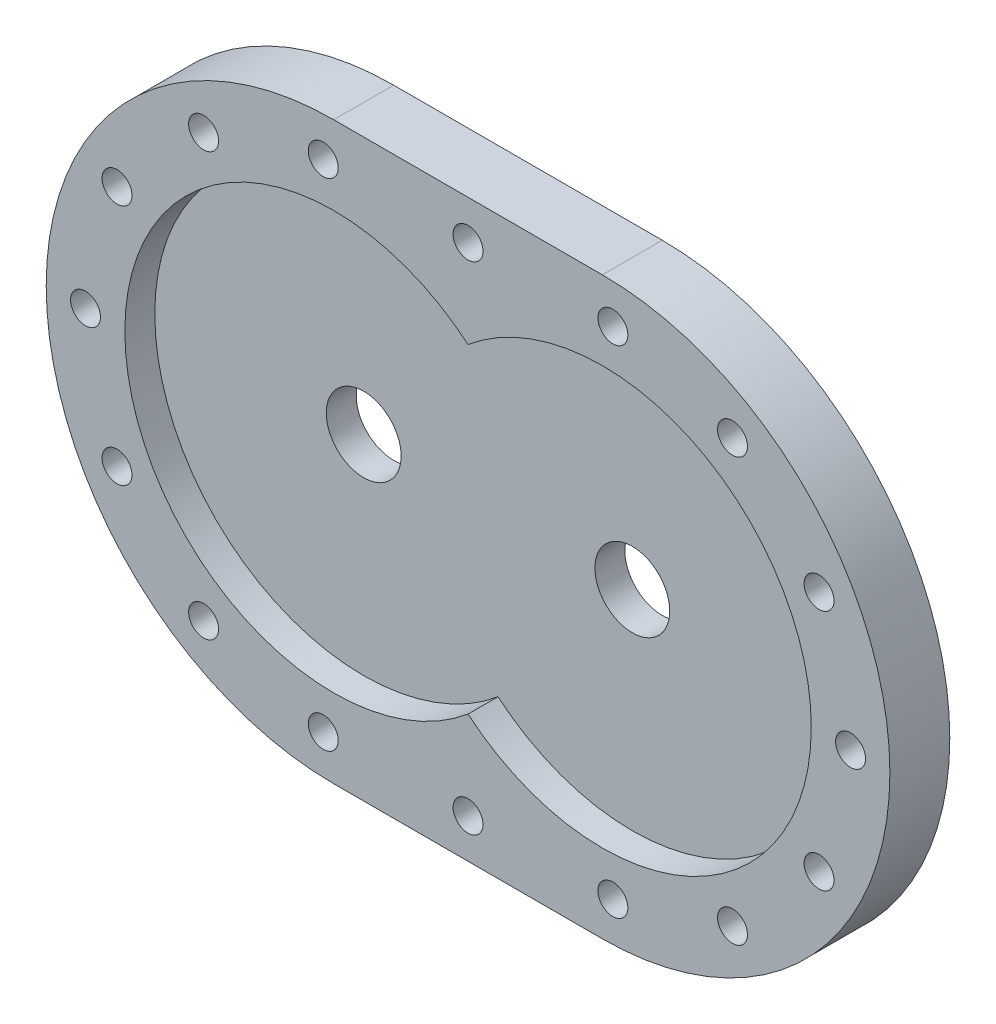
ISO-10303-21;
HEADER;
FILE_DESCRIPTION(('STEP AP214'),'2;1');
FILE_NAME('part.step','',(''),(''),'','','');
FILE_SCHEMA(('AUTOMOTIVE_DESIGN { 1 0 10303 214 1 1 1 1 }'));
ENDSEC;
DATA;
#1=APPLICATION_CONTEXT('core data for automotive mechanical design processes');
#2=APPLICATION_PROTOCOL_DEFINITION('international standard','automotive_design',2000,#1);
#3=PRODUCT_CONTEXT('',#1,'mechanical');
#4=PRODUCT('Part','Part','',(#3));
#5=PRODUCT_RELATED_PRODUCT_CATEGORY('part','',(#4));
#6=PRODUCT_DEFINITION_FORMATION('','',#4);
#7=PRODUCT_DEFINITION_CONTEXT('part definition',#1,'design');
#8=PRODUCT_DEFINITION('design','',#6,#7);
#9=PRODUCT_DEFINITION_SHAPE('','',#8);
#10=(LENGTH_UNIT() NAMED_UNIT(*) SI_UNIT(.MILLI.,.METRE.));
#11=(NAMED_UNIT(*) PLANE_ANGLE_UNIT() SI_UNIT($,.RADIAN.));
#12=(NAMED_UNIT(*) SI_UNIT($,.STERADIAN.) SOLID_ANGLE_UNIT());
#13=UNCERTAINTY_MEASURE_WITH_UNIT(LENGTH_MEASURE(1.E-05),#10,'distance_accuracy_value','');
#14=(GEOMETRIC_REPRESENTATION_CONTEXT(3) GLOBAL_UNCERTAINTY_ASSIGNED_CONTEXT((#13)) GLOBAL_UNIT_ASSIGNED_CONTEXT((#10,
#11,#12)) REPRESENTATION_CONTEXT('',''));
#15=CARTESIAN_POINT('',(0.,0.,0.));
#16=DIRECTION('',(0.,0.,1.));
#17=DIRECTION('',(1.,0.,0.));
#18=AXIS2_PLACEMENT_3D('',#15,#16,#17);
#19=CARTESIAN_POINT('',(0.,0.,20.));
#20=DIRECTION('',(0.,0.,-1.));
#21=DIRECTION('',(-1.,0.,0.));
#22=AXIS2_PLACEMENT_3D('',#19,#20,#21);
#23=CYLINDRICAL_SURFACE('',#22,96.);
#24=CARTESIAN_POINT('',(0.,0.,0.));
#25=DIRECTION('',(0.,0.,1.));
#26=DIRECTION('',(1.,0.,0.));
#27=AXIS2_PLACEMENT_3D('',#24,#25,#26);
#28=CIRCLE('',#27,96.);
#29=CARTESIAN_POINT('',(0.,96.,0.));
#30=VERTEX_POINT('',#29);
#31=CARTESIAN_POINT('',(0.,-96.,0.));
#32=VERTEX_POINT('',#31);
#33=EDGE_CURVE('E148',#30,#32,#28,.T.);
#34=ORIENTED_EDGE('',*,*,#33,.T.);
#35=DIRECTION('',(0.,0.,-1.));
#36=VECTOR('',#35,1.);
#37=CARTESIAN_POINT('',(0.,-96.,20.));
#38=LINE('',#37,#36);
#39=CARTESIAN_POINT('',(0.,-96.,20.));
#40=VERTEX_POINT('',#39);
#41=EDGE_CURVE('E13',#40,#32,#38,.T.);
#42=ORIENTED_EDGE('',*,*,#41,.F.);
#43=CARTESIAN_POINT('',(0.,0.,20.));
#44=DIRECTION('',(0.,0.,1.));
#45=DIRECTION('',(1.,0.,0.));
#46=AXIS2_PLACEMENT_3D('',#43,#44,#45);
#47=CIRCLE('',#46,96.);
#48=CARTESIAN_POINT('',(0.,96.,20.));
#49=VERTEX_POINT('',#48);
#50=EDGE_CURVE('E150',#49,#40,#47,.T.);
#51=ORIENTED_EDGE('',*,*,#50,.F.);
#52=DIRECTION('',(0.,0.,-1.));
#53=VECTOR('',#52,1.);
#54=CARTESIAN_POINT('',(0.,96.,20.));
#55=LINE('',#54,#53);
#56=EDGE_CURVE('E156',#49,#30,#55,.T.);
#57=ORIENTED_EDGE('',*,*,#56,.T.);
#58=EDGE_LOOP('',(#34,#42,#51,#57));
#59=FACE_BOUND('',#58,.T.);
#60=ADVANCED_FACE('F66',(#59),#23,.T.);
#61=CARTESIAN_POINT('',(0.,-96.,20.));
#62=DIRECTION('',(0.,1.,0.));
#63=DIRECTION('',(0.,0.,1.));
#64=AXIS2_PLACEMENT_3D('',#61,#62,#63);
#65=PLANE('',#64);
#66=DIRECTION('',(1.,0.,0.));
#67=VECTOR('',#66,1.);
#68=CARTESIAN_POINT('',(0.,-96.,0.));
#69=LINE('',#68,#67);
#70=CARTESIAN_POINT('',(89.69,-96.,0.));
#71=VERTEX_POINT('',#70);
#72=EDGE_CURVE('E159',#32,#71,#69,.T.);
#73=ORIENTED_EDGE('',*,*,#72,.T.);
#74=DIRECTION('',(0.,0.,-1.));
#75=VECTOR('',#74,1.);
#76=CARTESIAN_POINT('',(89.69,-96.,20.));
#77=LINE('',#76,#75);
#78=CARTESIAN_POINT('',(89.69,-96.,20.));
#79=VERTEX_POINT('',#78);
#80=EDGE_CURVE('E73',#79,#71,#77,.T.);
#81=ORIENTED_EDGE('',*,*,#80,.F.);
#82=DIRECTION('',(1.,0.,0.));
#83=VECTOR('',#82,1.);
#84=CARTESIAN_POINT('',(0.,-96.,20.));
#85=LINE('',#84,#83);
#86=EDGE_CURVE('E117',#40,#79,#85,.T.);
#87=ORIENTED_EDGE('',*,*,#86,.F.);
#88=ORIENTED_EDGE('',*,*,#41,.T.);
#89=EDGE_LOOP('',(#73,#81,#87,#88));
#90=FACE_BOUND('',#89,.T.);
#91=ADVANCED_FACE('F188',(#90),#65,.F.);
#92=CARTESIAN_POINT('',(89.69,0.,20.));
#93=DIRECTION('',(0.,0.,-1.));
#94=DIRECTION('',(-1.,0.,0.));
#95=AXIS2_PLACEMENT_3D('',#92,#93,#94);
#96=CYLINDRICAL_SURFACE('',#95,96.);
#97=CARTESIAN_POINT('',(89.69,0.,0.));
#98=DIRECTION('',(0.,0.,1.));
#99=DIRECTION('',(1.,0.,0.));
#100=AXIS2_PLACEMENT_3D('',#97,#98,#99);
#101=CIRCLE('',#100,96.);
#102=CARTESIAN_POINT('',(89.69,96.,0.));
#103=VERTEX_POINT('',#102);
#104=EDGE_CURVE('E161',#71,#103,#101,.T.);
#105=ORIENTED_EDGE('',*,*,#104,.T.);
#106=DIRECTION('',(0.,0.,-1.));
#107=VECTOR('',#106,1.);
#108=CARTESIAN_POINT('',(89.69,96.,20.));
#109=LINE('',#108,#107);
#110=CARTESIAN_POINT('',(89.69,96.,20.));
#111=VERTEX_POINT('',#110);
#112=EDGE_CURVE('E165',#111,#103,#109,.T.);
#113=ORIENTED_EDGE('',*,*,#112,.F.);
#114=CARTESIAN_POINT('',(89.69,0.,20.));
#115=DIRECTION('',(0.,0.,1.));
#116=DIRECTION('',(1.,0.,0.));
#117=AXIS2_PLACEMENT_3D('',#114,#115,#116);
#118=CIRCLE('',#117,96.);
#119=EDGE_CURVE('E153',#79,#111,#118,.T.);
#120=ORIENTED_EDGE('',*,*,#119,.F.);
#121=ORIENTED_EDGE('',*,*,#80,.T.);
#122=EDGE_LOOP('',(#105,#113,#120,#121));
#123=FACE_BOUND('',#122,.T.);
#124=ADVANCED_FACE('F170',(#123),#96,.T.);
#125=CARTESIAN_POINT('',(0.,96.,20.));
#126=DIRECTION('',(0.,-1.,0.));
#127=DIRECTION('',(0.,0.,-1.));
#128=AXIS2_PLACEMENT_3D('',#125,#126,#127);
#129=PLANE('',#128);
#130=DIRECTION('',(-1.,0.,0.));
#131=VECTOR('',#130,1.);
#132=CARTESIAN_POINT('',(0.,96.,0.));
#133=LINE('',#132,#131);
#134=EDGE_CURVE('E110',#103,#30,#133,.T.);
#135=ORIENTED_EDGE('',*,*,#134,.T.);
#136=ORIENTED_EDGE('',*,*,#56,.F.);
#137=DIRECTION('',(-1.,0.,0.));
#138=VECTOR('',#137,1.);
#139=CARTESIAN_POINT('',(0.,96.,20.));
#140=LINE('',#139,#138);
#141=EDGE_CURVE('E89',#111,#49,#140,.T.);
#142=ORIENTED_EDGE('',*,*,#141,.F.);
#143=ORIENTED_EDGE('',*,*,#112,.T.);
#144=EDGE_LOOP('',(#135,#136,#142,#143));
#145=FACE_BOUND('',#144,.T.);
#146=ADVANCED_FACE('F178',(#145),#129,.F.);
#147=CARTESIAN_POINT('',(0.,0.,20.));
#148=DIRECTION('',(0.,0.,1.));
#149=DIRECTION('',(1.,0.,0.));
#150=AXIS2_PLACEMENT_3D('',#147,#148,#149);
#151=PLANE('',#150);
#152=CARTESIAN_POINT('',(133.136958542324,70.5735603354516,20.));
#153=DIRECTION('',(0.,0.,1.));
#154=DIRECTION('',(1.,0.,0.));
#155=AXIS2_PLACEMENT_3D('',#152,#153,#154);
#156=CIRCLE('',#155,4.99999999999999);
#157=CARTESIAN_POINT('',(138.136958542323,70.5735603354516,20.));
#158=VERTEX_POINT('',#157);
#159=EDGE_CURVE('E435',#158,#158,#156,.T.);
#160=ORIENTED_EDGE('',*,*,#159,.F.);
#161=EDGE_LOOP('',(#160));
#162=FACE_BOUND('',#161,.T.);
#163=CARTESIAN_POINT('',(93.1985017942048,82.8007007226392,20.));
#164=DIRECTION('',(0.,0.,1.));
#165=DIRECTION('',(1.,0.,0.));
#166=AXIS2_PLACEMENT_3D('',#163,#164,#165);
#167=CIRCLE('',#166,4.99999999999999);
#168=CARTESIAN_POINT('',(98.1985017942048,82.8007007226392,20.));
#169=VERTEX_POINT('',#168);
#170=EDGE_CURVE('E441',#169,#169,#167,.T.);
#171=ORIENTED_EDGE('',*,*,#170,.F.);
#172=EDGE_LOOP('',(#171));
#173=FACE_BOUND('',#172,.T.);
#174=CARTESIAN_POINT('',(44.845,82.875,20.));
#175=DIRECTION('',(0.,0.,1.));
#176=DIRECTION('',(1.,0.,0.));
#177=AXIS2_PLACEMENT_3D('',#174,#175,#176);
#178=CIRCLE('',#177,4.99999999999999);
#179=CARTESIAN_POINT('',(49.845,82.875,20.));
#180=VERTEX_POINT('',#179);
#181=EDGE_CURVE('E450',#180,#180,#178,.T.);
#182=ORIENTED_EDGE('',*,*,#181,.F.);
#183=EDGE_LOOP('',(#182));
#184=FACE_BOUND('',#183,.T.);
#185=CARTESIAN_POINT('',(-3.50850179420473,82.8007007226392,20.));
#186=DIRECTION('',(0.,0.,1.));
#187=DIRECTION('',(1.,0.,0.));
#188=AXIS2_PLACEMENT_3D('',#185,#186,#187);
#189=CIRCLE('',#188,4.99999999999999);
#190=CARTESIAN_POINT('',(1.49149820579526,82.8007007226392,20.));
#191=VERTEX_POINT('',#190);
#192=EDGE_CURVE('E456',#191,#191,#189,.T.);
#193=ORIENTED_EDGE('',*,*,#192,.F.);
#194=EDGE_LOOP('',(#193));
#195=FACE_BOUND('',#194,.T.);
#196=CARTESIAN_POINT('',(-43.4469585423235,70.5735603354516,20.));
#197=DIRECTION('',(0.,0.,1.));
#198=DIRECTION('',(1.,0.,0.));
#199=AXIS2_PLACEMENT_3D('',#196,#197,#198);
#200=CIRCLE('',#199,4.99999999999999);
#201=CARTESIAN_POINT('',(-38.4469585423235,70.5735603354516,20.));
#202=VERTEX_POINT('',#201);
#203=EDGE_CURVE('E462',#202,#202,#200,.T.);
#204=ORIENTED_EDGE('',*,*,#203,.F.);
#205=EDGE_LOOP('',(#204));
#206=FACE_BOUND('',#205,.T.);
#207=CARTESIAN_POINT('',(-72.3496106216027,40.4202853515716,20.));
#208=DIRECTION('',(0.,0.,1.));
#209=DIRECTION('',(1.,0.,0.));
#210=AXIS2_PLACEMENT_3D('',#207,#208,#209);
#211=CIRCLE('',#210,4.99999999999999);
#212=CARTESIAN_POINT('',(-67.3496106216027,40.4202853515716,20.));
#213=VERTEX_POINT('',#212);
#214=EDGE_CURVE('E468',#213,#213,#211,.T.);
#215=ORIENTED_EDGE('',*,*,#214,.F.);
#216=EDGE_LOOP('',(#215));
#217=FACE_BOUND('',#216,.T.);
#218=CARTESIAN_POINT('',(-82.875,0.,20.));
#219=DIRECTION('',(0.,0.,1.));
#220=DIRECTION('',(1.,0.,0.));
#221=AXIS2_PLACEMENT_3D('',#218,#219,#220);
#222=CIRCLE('',#221,4.99999999999999);
#223=CARTESIAN_POINT('',(-77.875,0.,20.));
#224=VERTEX_POINT('',#223);
#225=EDGE_CURVE('E474',#224,#224,#222,.T.);
#226=ORIENTED_EDGE('',*,*,#225,.F.);
#227=EDGE_LOOP('',(#226));
#228=FACE_BOUND('',#227,.T.);
#229=CARTESIAN_POINT('',(-72.3496106216028,-40.4202853515715,20.));
#230=DIRECTION('',(0.,0.,1.));
#231=DIRECTION('',(1.,0.,0.));
#232=AXIS2_PLACEMENT_3D('',#229,#230,#231);
#233=CIRCLE('',#232,4.99999999999999);
#234=CARTESIAN_POINT('',(-67.3496106216028,-40.4202853515715,20.));
#235=VERTEX_POINT('',#234);
#236=EDGE_CURVE('E480',#235,#235,#233,.T.);
#237=ORIENTED_EDGE('',*,*,#236,.F.);
#238=EDGE_LOOP('',(#237));
#239=FACE_BOUND('',#238,.T.);
#240=CARTESIAN_POINT('',(-43.4469585423237,-70.5735603354515,20.));
#241=DIRECTION('',(0.,0.,1.));
#242=DIRECTION('',(1.,0.,0.));
#243=AXIS2_PLACEMENT_3D('',#240,#241,#242);
#244=CIRCLE('',#243,4.99999999999999);
#245=CARTESIAN_POINT('',(-38.4469585423237,-70.5735603354515,20.));
#246=VERTEX_POINT('',#245);
#247=EDGE_CURVE('E527',#246,#246,#244,.T.);
#248=ORIENTED_EDGE('',*,*,#247,.F.);
#249=EDGE_LOOP('',(#248));
#250=FACE_BOUND('',#249,.T.);
#251=CARTESIAN_POINT('',(-3.50850179420487,-82.8007007226392,20.));
#252=DIRECTION('',(0.,0.,1.));
#253=DIRECTION('',(1.,0.,0.));
#254=AXIS2_PLACEMENT_3D('',#251,#252,#253);
#255=CIRCLE('',#254,4.99999999999999);
#256=CARTESIAN_POINT('',(1.49149820579512,-82.8007007226392,20.));
#257=VERTEX_POINT('',#256);
#258=EDGE_CURVE('E537',#257,#257,#255,.T.);
#259=ORIENTED_EDGE('',*,*,#258,.F.);
#260=EDGE_LOOP('',(#259));
#261=FACE_BOUND('',#260,.T.);
#262=CARTESIAN_POINT('',(44.8449999999999,-82.875,20.));
#263=DIRECTION('',(0.,0.,1.));
#264=DIRECTION('',(1.,0.,0.));
#265=AXIS2_PLACEMENT_3D('',#262,#263,#264);
#266=CIRCLE('',#265,4.99999999999999);
#267=CARTESIAN_POINT('',(49.8449999999999,-82.875,20.));
#268=VERTEX_POINT('',#267);
#269=EDGE_CURVE('E543',#268,#268,#266,.T.);
#270=ORIENTED_EDGE('',*,*,#269,.F.);
#271=EDGE_LOOP('',(#270));
#272=FACE_BOUND('',#271,.T.);
#273=CARTESIAN_POINT('',(93.1985017942047,-82.8007007226392,20.));
#274=DIRECTION('',(0.,0.,1.));
#275=DIRECTION('',(1.,0.,0.));
#276=AXIS2_PLACEMENT_3D('',#273,#274,#275);
#277=CIRCLE('',#276,4.99999999999999);
#278=CARTESIAN_POINT('',(98.1985017942047,-82.8007007226392,20.));
#279=VERTEX_POINT('',#278);
#280=EDGE_CURVE('E549',#279,#279,#277,.T.);
#281=ORIENTED_EDGE('',*,*,#280,.F.);
#282=EDGE_LOOP('',(#281));
#283=FACE_BOUND('',#282,.T.);
#284=CARTESIAN_POINT('',(133.136958542324,-70.5735603354516,20.));
#285=DIRECTION('',(0.,0.,1.));
#286=DIRECTION('',(1.,0.,0.));
#287=AXIS2_PLACEMENT_3D('',#284,#285,#286);
#288=CIRCLE('',#287,4.99999999999999);
#289=CARTESIAN_POINT('',(138.136958542323,-70.5735603354516,20.));
#290=VERTEX_POINT('',#289);
#291=EDGE_CURVE('E555',#290,#290,#288,.T.);
#292=ORIENTED_EDGE('',*,*,#291,.F.);
#293=EDGE_LOOP('',(#292));
#294=FACE_BOUND('',#293,.T.);
#295=CARTESIAN_POINT('',(162.039610621603,-40.4202853515716,20.));
#296=DIRECTION('',(0.,0.,1.));
#297=DIRECTION('',(1.,0.,0.));
#298=AXIS2_PLACEMENT_3D('',#295,#296,#297);
#299=CIRCLE('',#298,4.99999999999999);
#300=CARTESIAN_POINT('',(167.039610621603,-40.4202853515716,20.));
#301=VERTEX_POINT('',#300);
#302=EDGE_CURVE('E560',#301,#301,#299,.T.);
#303=ORIENTED_EDGE('',*,*,#302,.F.);
#304=EDGE_LOOP('',(#303));
#305=FACE_BOUND('',#304,.T.);
#306=CARTESIAN_POINT('',(162.039610621603,40.4202853515716,20.));
#307=DIRECTION('',(0.,0.,1.));
#308=DIRECTION('',(1.,0.,0.));
#309=AXIS2_PLACEMENT_3D('',#306,#307,#308);
#310=CIRCLE('',#309,4.99999999999999);
#311=CARTESIAN_POINT('',(167.039610621603,40.4202853515716,20.));
#312=VERTEX_POINT('',#311);
#313=EDGE_CURVE('E438',#312,#312,#310,.T.);
#314=ORIENTED_EDGE('',*,*,#313,.F.);
#315=EDGE_LOOP('',(#314));
#316=FACE_BOUND('',#315,.T.);
#317=CARTESIAN_POINT('',(172.565,0.,20.));
#318=DIRECTION('',(0.,0.,1.));
#319=DIRECTION('',(1.,0.,0.));
#320=AXIS2_PLACEMENT_3D('',#317,#318,#319);
#321=CIRCLE('',#320,4.99999999999999);
#322=CARTESIAN_POINT('',(177.565,0.,20.));
#323=VERTEX_POINT('',#322);
#324=EDGE_CURVE('E487',#323,#323,#321,.T.);
#325=ORIENTED_EDGE('',*,*,#324,.F.);
#326=EDGE_LOOP('',(#325));
#327=FACE_BOUND('',#326,.T.);
#328=CARTESIAN_POINT('',(0.,0.,20.));
#329=DIRECTION('',(0.,0.,1.));
#330=DIRECTION('',(1.,0.,0.));
#331=AXIS2_PLACEMENT_3D('',#328,#329,#330);
#332=CIRCLE('',#331,69.75);
#333=CARTESIAN_POINT('',(44.845,53.4227336908175,20.));
#334=VERTEX_POINT('',#333);
#335=CARTESIAN_POINT('',(44.845,-53.4227336908175,20.));
#336=VERTEX_POINT('',#335);
#337=EDGE_CURVE('E80',#334,#336,#332,.T.);
#338=ORIENTED_EDGE('',*,*,#337,.F.);
#339=CARTESIAN_POINT('',(89.69,0.,20.));
#340=DIRECTION('',(0.,0.,1.));
#341=DIRECTION('',(1.,0.,0.));
#342=AXIS2_PLACEMENT_3D('',#339,#340,#341);
#343=CIRCLE('',#342,69.75);
#344=EDGE_CURVE('E139',#336,#334,#343,.T.);
#345=ORIENTED_EDGE('',*,*,#344,.F.);
#346=EDGE_LOOP('',(#338,#345));
#347=FACE_BOUND('',#346,.T.);
#348=ORIENTED_EDGE('',*,*,#50,.T.);
#349=ORIENTED_EDGE('',*,*,#86,.T.);
#350=ORIENTED_EDGE('',*,*,#119,.T.);
#351=ORIENTED_EDGE('',*,*,#141,.T.);
#352=EDGE_LOOP('',(#348,#349,#350,#351));
#353=FACE_BOUND('',#352,.T.);
#354=ADVANCED_FACE('F180',(#162,#173,#184,#195,#206,#217,#228,#239,#250,#261,#272,#283,#294,
#305,#316,#327,#347,#353),#151,.T.);
#355=CARTESIAN_POINT('',(0.,0.,0.));
#356=DIRECTION('',(0.,0.,1.));
#357=DIRECTION('',(1.,0.,0.));
#358=AXIS2_PLACEMENT_3D('',#355,#356,#357);
#359=PLANE('',#358);
#360=CARTESIAN_POINT('',(133.136958542324,70.5735603354516,0.));
#361=DIRECTION('',(0.,0.,1.));
#362=DIRECTION('',(1.,0.,0.));
#363=AXIS2_PLACEMENT_3D('',#360,#361,#362);
#364=CIRCLE('',#363,4.99999999999999);
#365=CARTESIAN_POINT('',(138.136958542323,70.5735603354516,0.));
#366=VERTEX_POINT('',#365);
#367=EDGE_CURVE('E432',#366,#366,#364,.T.);
#368=ORIENTED_EDGE('',*,*,#367,.T.);
#369=EDGE_LOOP('',(#368));
#370=FACE_BOUND('',#369,.T.);
#371=CARTESIAN_POINT('',(93.1985017942048,82.8007007226392,0.));
#372=DIRECTION('',(0.,0.,1.));
#373=DIRECTION('',(1.,0.,0.));
#374=AXIS2_PLACEMENT_3D('',#371,#372,#373);
#375=CIRCLE('',#374,4.99999999999999);
#376=CARTESIAN_POINT('',(98.1985017942048,82.8007007226392,0.));
#377=VERTEX_POINT('',#376);
#378=EDGE_CURVE('E436',#377,#377,#375,.T.);
#379=ORIENTED_EDGE('',*,*,#378,.T.);
#380=EDGE_LOOP('',(#379));
#381=FACE_BOUND('',#380,.T.);
#382=CARTESIAN_POINT('',(44.845,82.875,0.));
#383=DIRECTION('',(0.,0.,1.));
#384=DIRECTION('',(1.,0.,0.));
#385=AXIS2_PLACEMENT_3D('',#382,#383,#384);
#386=CIRCLE('',#385,4.99999999999999);
#387=CARTESIAN_POINT('',(49.845,82.875,0.));
#388=VERTEX_POINT('',#387);
#389=EDGE_CURVE('E447',#388,#388,#386,.T.);
#390=ORIENTED_EDGE('',*,*,#389,.T.);
#391=EDGE_LOOP('',(#390));
#392=FACE_BOUND('',#391,.T.);
#393=CARTESIAN_POINT('',(-3.50850179420473,82.8007007226392,0.));
#394=DIRECTION('',(0.,0.,1.));
#395=DIRECTION('',(1.,0.,0.));
#396=AXIS2_PLACEMENT_3D('',#393,#394,#395);
#397=CIRCLE('',#396,4.99999999999999);
#398=CARTESIAN_POINT('',(1.49149820579526,82.8007007226392,0.));
#399=VERTEX_POINT('',#398);
#400=EDGE_CURVE('E453',#399,#399,#397,.T.);
#401=ORIENTED_EDGE('',*,*,#400,.T.);
#402=EDGE_LOOP('',(#401));
#403=FACE_BOUND('',#402,.T.);
#404=CARTESIAN_POINT('',(-43.4469585423235,70.5735603354516,0.));
#405=DIRECTION('',(0.,0.,1.));
#406=DIRECTION('',(1.,0.,0.));
#407=AXIS2_PLACEMENT_3D('',#404,#405,#406);
#408=CIRCLE('',#407,4.99999999999999);
#409=CARTESIAN_POINT('',(-38.4469585423235,70.5735603354516,0.));
#410=VERTEX_POINT('',#409);
#411=EDGE_CURVE('E459',#410,#410,#408,.T.);
#412=ORIENTED_EDGE('',*,*,#411,.T.);
#413=EDGE_LOOP('',(#412));
#414=FACE_BOUND('',#413,.T.);
#415=CARTESIAN_POINT('',(-72.3496106216027,40.4202853515716,0.));
#416=DIRECTION('',(0.,0.,1.));
#417=DIRECTION('',(1.,0.,0.));
#418=AXIS2_PLACEMENT_3D('',#415,#416,#417);
#419=CIRCLE('',#418,4.99999999999999);
#420=CARTESIAN_POINT('',(-67.3496106216027,40.4202853515716,0.));
#421=VERTEX_POINT('',#420);
#422=EDGE_CURVE('E465',#421,#421,#419,.T.);
#423=ORIENTED_EDGE('',*,*,#422,.T.);
#424=EDGE_LOOP('',(#423));
#425=FACE_BOUND('',#424,.T.);
#426=CARTESIAN_POINT('',(-82.875,0.,0.));
#427=DIRECTION('',(0.,0.,1.));
#428=DIRECTION('',(1.,0.,0.));
#429=AXIS2_PLACEMENT_3D('',#426,#427,#428);
#430=CIRCLE('',#429,4.99999999999999);
#431=CARTESIAN_POINT('',(-77.875,0.,0.));
#432=VERTEX_POINT('',#431);
#433=EDGE_CURVE('E471',#432,#432,#430,.T.);
#434=ORIENTED_EDGE('',*,*,#433,.T.);
#435=EDGE_LOOP('',(#434));
#436=FACE_BOUND('',#435,.T.);
#437=CARTESIAN_POINT('',(-72.3496106216028,-40.4202853515715,0.));
#438=DIRECTION('',(0.,0.,1.));
#439=DIRECTION('',(1.,0.,0.));
#440=AXIS2_PLACEMENT_3D('',#437,#438,#439);
#441=CIRCLE('',#440,4.99999999999999);
#442=CARTESIAN_POINT('',(-67.3496106216028,-40.4202853515715,0.));
#443=VERTEX_POINT('',#442);
#444=EDGE_CURVE('E477',#443,#443,#441,.T.);
#445=ORIENTED_EDGE('',*,*,#444,.T.);
#446=EDGE_LOOP('',(#445));
#447=FACE_BOUND('',#446,.T.);
#448=CARTESIAN_POINT('',(-43.4469585423237,-70.5735603354515,0.));
#449=DIRECTION('',(0.,0.,1.));
#450=DIRECTION('',(1.,0.,0.));
#451=AXIS2_PLACEMENT_3D('',#448,#449,#450);
#452=CIRCLE('',#451,4.99999999999999);
#453=CARTESIAN_POINT('',(-38.4469585423237,-70.5735603354515,0.));
#454=VERTEX_POINT('',#453);
#455=EDGE_CURVE('E483',#454,#454,#452,.T.);
#456=ORIENTED_EDGE('',*,*,#455,.T.);
#457=EDGE_LOOP('',(#456));
#458=FACE_BOUND('',#457,.T.);
#459=CARTESIAN_POINT('',(-3.50850179420487,-82.8007007226392,0.));
#460=DIRECTION('',(0.,0.,1.));
#461=DIRECTION('',(1.,0.,0.));
#462=AXIS2_PLACEMENT_3D('',#459,#460,#461);
#463=CIRCLE('',#462,4.99999999999999);
#464=CARTESIAN_POINT('',(1.49149820579512,-82.8007007226392,0.));
#465=VERTEX_POINT('',#464);
#466=EDGE_CURVE('E532',#465,#465,#463,.T.);
#467=ORIENTED_EDGE('',*,*,#466,.T.);
#468=EDGE_LOOP('',(#467));
#469=FACE_BOUND('',#468,.T.);
#470=CARTESIAN_POINT('',(44.8449999999999,-82.875,0.));
#471=DIRECTION('',(0.,0.,1.));
#472=DIRECTION('',(1.,0.,0.));
#473=AXIS2_PLACEMENT_3D('',#470,#471,#472);
#474=CIRCLE('',#473,4.99999999999999);
#475=CARTESIAN_POINT('',(49.8449999999999,-82.875,0.));
#476=VERTEX_POINT('',#475);
#477=EDGE_CURVE('E540',#476,#476,#474,.T.);
#478=ORIENTED_EDGE('',*,*,#477,.T.);
#479=EDGE_LOOP('',(#478));
#480=FACE_BOUND('',#479,.T.);
#481=CARTESIAN_POINT('',(93.1985017942047,-82.8007007226392,0.));
#482=DIRECTION('',(0.,0.,1.));
#483=DIRECTION('',(1.,0.,0.));
#484=AXIS2_PLACEMENT_3D('',#481,#482,#483);
#485=CIRCLE('',#484,4.99999999999999);
#486=CARTESIAN_POINT('',(98.1985017942047,-82.8007007226392,0.));
#487=VERTEX_POINT('',#486);
#488=EDGE_CURVE('E546',#487,#487,#485,.T.);
#489=ORIENTED_EDGE('',*,*,#488,.T.);
#490=EDGE_LOOP('',(#489));
#491=FACE_BOUND('',#490,.T.);
#492=CARTESIAN_POINT('',(133.136958542324,-70.5735603354516,0.));
#493=DIRECTION('',(0.,0.,1.));
#494=DIRECTION('',(1.,0.,0.));
#495=AXIS2_PLACEMENT_3D('',#492,#493,#494);
#496=CIRCLE('',#495,4.99999999999999);
#497=CARTESIAN_POINT('',(138.136958542323,-70.5735603354516,0.));
#498=VERTEX_POINT('',#497);
#499=EDGE_CURVE('E552',#498,#498,#496,.T.);
#500=ORIENTED_EDGE('',*,*,#499,.T.);
#501=EDGE_LOOP('',(#500));
#502=FACE_BOUND('',#501,.T.);
#503=CARTESIAN_POINT('',(162.039610621603,-40.4202853515716,0.));
#504=DIRECTION('',(0.,0.,1.));
#505=DIRECTION('',(1.,0.,0.));
#506=AXIS2_PLACEMENT_3D('',#503,#504,#505);
#507=CIRCLE('',#506,4.99999999999999);
#508=CARTESIAN_POINT('',(167.039610621603,-40.4202853515716,0.));
#509=VERTEX_POINT('',#508);
#510=EDGE_CURVE('E558',#509,#509,#507,.T.);
#511=ORIENTED_EDGE('',*,*,#510,.T.);
#512=EDGE_LOOP('',(#511));
#513=FACE_BOUND('',#512,.T.);
#514=CARTESIAN_POINT('',(162.039610621603,40.4202853515716,0.));
#515=DIRECTION('',(0.,0.,1.));
#516=DIRECTION('',(1.,0.,0.));
#517=AXIS2_PLACEMENT_3D('',#514,#515,#516);
#518=CIRCLE('',#517,4.99999999999999);
#519=CARTESIAN_POINT('',(167.039610621603,40.4202853515716,0.));
#520=VERTEX_POINT('',#519);
#521=EDGE_CURVE('E484',#520,#520,#518,.T.);
#522=ORIENTED_EDGE('',*,*,#521,.T.);
#523=EDGE_LOOP('',(#522));
#524=FACE_BOUND('',#523,.T.);
#525=CARTESIAN_POINT('',(172.565,0.,0.));
#526=DIRECTION('',(0.,0.,1.));
#527=DIRECTION('',(1.,0.,0.));
#528=AXIS2_PLACEMENT_3D('',#525,#526,#527);
#529=CIRCLE('',#528,4.99999999999999);
#530=CARTESIAN_POINT('',(177.565,0.,0.));
#531=VERTEX_POINT('',#530);
#532=EDGE_CURVE('E490',#531,#531,#529,.T.);
#533=ORIENTED_EDGE('',*,*,#532,.T.);
#534=EDGE_LOOP('',(#533));
#535=FACE_BOUND('',#534,.T.);
#536=CARTESIAN_POINT('',(0.,0.,0.));
#537=DIRECTION('',(0.,0.,1.));
#538=DIRECTION('',(1.,0.,0.));
#539=AXIS2_PLACEMENT_3D('',#536,#537,#538);
#540=CIRCLE('',#539,12.5);
#541=CARTESIAN_POINT('',(12.5,0.,0.));
#542=VERTEX_POINT('',#541);
#543=EDGE_CURVE('E146',#542,#542,#540,.T.);
#544=ORIENTED_EDGE('',*,*,#543,.T.);
#545=EDGE_LOOP('',(#544));
#546=FACE_BOUND('',#545,.T.);
#547=CARTESIAN_POINT('',(89.69,0.,0.));
#548=DIRECTION('',(0.,0.,1.));
#549=DIRECTION('',(1.,0.,0.));
#550=AXIS2_PLACEMENT_3D('',#547,#548,#549);
#551=CIRCLE('',#550,12.5);
#552=CARTESIAN_POINT('',(102.19,0.,0.));
#553=VERTEX_POINT('',#552);
#554=EDGE_CURVE('E501',#553,#553,#551,.T.);
#555=ORIENTED_EDGE('',*,*,#554,.T.);
#556=EDGE_LOOP('',(#555));
#557=FACE_BOUND('',#556,.T.);
#558=ORIENTED_EDGE('',*,*,#33,.F.);
#559=ORIENTED_EDGE('',*,*,#134,.F.);
#560=ORIENTED_EDGE('',*,*,#104,.F.);
#561=ORIENTED_EDGE('',*,*,#72,.F.);
#562=EDGE_LOOP('',(#558,#559,#560,#561));
#563=FACE_BOUND('',#562,.T.);
#564=ADVANCED_FACE('F174',(#370,#381,#392,#403,#414,#425,#436,#447,#458,#469,#480,#491,#502,
#513,#524,#535,#546,#557,#563),#359,.F.);
#565=CARTESIAN_POINT('',(0.,0.,10.));
#566=DIRECTION('',(0.,0.,1.));
#567=DIRECTION('',(1.,0.,0.));
#568=AXIS2_PLACEMENT_3D('',#565,#566,#567);
#569=CYLINDRICAL_SURFACE('',#568,69.75);
#570=ORIENTED_EDGE('',*,*,#337,.T.);
#571=DIRECTION('',(0.,0.,1.));
#572=VECTOR('',#571,1.);
#573=CARTESIAN_POINT('',(44.845,-53.4227336908175,10.));
#574=LINE('',#573,#572);
#575=CARTESIAN_POINT('',(44.845,-53.4227336908175,10.));
#576=VERTEX_POINT('',#575);
#577=EDGE_CURVE('E125',#576,#336,#574,.T.);
#578=ORIENTED_EDGE('',*,*,#577,.F.);
#579=CARTESIAN_POINT('',(0.,0.,10.));
#580=DIRECTION('',(0.,0.,1.));
#581=DIRECTION('',(1.,0.,0.));
#582=AXIS2_PLACEMENT_3D('',#579,#580,#581);
#583=CIRCLE('',#582,69.75);
#584=CARTESIAN_POINT('',(44.845,53.4227336908175,10.));
#585=VERTEX_POINT('',#584);
#586=EDGE_CURVE('E128',#585,#576,#583,.T.);
#587=ORIENTED_EDGE('',*,*,#586,.F.);
#588=DIRECTION('',(0.,0.,1.));
#589=VECTOR('',#588,1.);
#590=CARTESIAN_POINT('',(44.845,53.4227336908175,10.));
#591=LINE('',#590,#589);
#592=EDGE_CURVE('E134',#585,#334,#591,.T.);
#593=ORIENTED_EDGE('',*,*,#592,.T.);
#594=EDGE_LOOP('',(#570,#578,#587,#593));
#595=FACE_BOUND('',#594,.T.);
#596=ADVANCED_FACE('F127',(#595),#569,.F.);
#597=CARTESIAN_POINT('',(89.69,0.,10.));
#598=DIRECTION('',(0.,0.,1.));
#599=DIRECTION('',(1.,0.,0.));
#600=AXIS2_PLACEMENT_3D('',#597,#598,#599);
#601=CYLINDRICAL_SURFACE('',#600,69.75);
#602=ORIENTED_EDGE('',*,*,#344,.T.);
#603=ORIENTED_EDGE('',*,*,#592,.F.);
#604=CARTESIAN_POINT('',(89.69,0.,10.));
#605=DIRECTION('',(0.,0.,1.));
#606=DIRECTION('',(1.,0.,0.));
#607=AXIS2_PLACEMENT_3D('',#604,#605,#606);
#608=CIRCLE('',#607,69.75);
#609=EDGE_CURVE('E135',#576,#585,#608,.T.);
#610=ORIENTED_EDGE('',*,*,#609,.F.);
#611=ORIENTED_EDGE('',*,*,#577,.T.);
#612=EDGE_LOOP('',(#602,#603,#610,#611));
#613=FACE_BOUND('',#612,.T.);
#614=ADVANCED_FACE('F141',(#613),#601,.F.);
#615=CARTESIAN_POINT('',(0.,0.,10.));
#616=DIRECTION('',(0.,0.,1.));
#617=DIRECTION('',(1.,0.,0.));
#618=AXIS2_PLACEMENT_3D('',#615,#616,#617);
#619=PLANE('',#618);
#620=CARTESIAN_POINT('',(0.,0.,10.));
#621=DIRECTION('',(0.,0.,1.));
#622=DIRECTION('',(1.,0.,0.));
#623=AXIS2_PLACEMENT_3D('',#620,#621,#622);
#624=CIRCLE('',#623,12.5);
#625=CARTESIAN_POINT('',(12.5,0.,10.));
#626=VERTEX_POINT('',#625);
#627=EDGE_CURVE('E498',#626,#626,#624,.T.);
#628=ORIENTED_EDGE('',*,*,#627,.F.);
#629=EDGE_LOOP('',(#628));
#630=FACE_BOUND('',#629,.T.);
#631=CARTESIAN_POINT('',(89.69,0.,10.));
#632=DIRECTION('',(0.,0.,1.));
#633=DIRECTION('',(1.,0.,0.));
#634=AXIS2_PLACEMENT_3D('',#631,#632,#633);
#635=CIRCLE('',#634,12.5);
#636=CARTESIAN_POINT('',(102.19,0.,10.));
#637=VERTEX_POINT('',#636);
#638=EDGE_CURVE('E493',#637,#637,#635,.T.);
#639=ORIENTED_EDGE('',*,*,#638,.F.);
#640=EDGE_LOOP('',(#639));
#641=FACE_BOUND('',#640,.T.);
#642=ORIENTED_EDGE('',*,*,#586,.T.);
#643=ORIENTED_EDGE('',*,*,#609,.T.);
#644=EDGE_LOOP('',(#642,#643));
#645=FACE_BOUND('',#644,.T.);
#646=ADVANCED_FACE('F138',(#630,#641,#645),#619,.T.);
#647=CARTESIAN_POINT('',(89.69,0.,0.));
#648=DIRECTION('',(0.,0.,1.));
#649=DIRECTION('',(1.,0.,0.));
#650=AXIS2_PLACEMENT_3D('',#647,#648,#649);
#651=CYLINDRICAL_SURFACE('',#650,12.5);
#652=ORIENTED_EDGE('',*,*,#554,.F.);
#653=EDGE_LOOP('',(#652));
#654=FACE_BOUND('',#653,.T.);
#655=ORIENTED_EDGE('',*,*,#638,.T.);
#656=EDGE_LOOP('',(#655));
#657=FACE_BOUND('',#656,.T.);
#658=ADVANCED_FACE('F234',(#654,#657),#651,.F.);
#659=CARTESIAN_POINT('',(0.,0.,0.));
#660=DIRECTION('',(0.,0.,1.));
#661=DIRECTION('',(1.,0.,0.));
#662=AXIS2_PLACEMENT_3D('',#659,#660,#661);
#663=CYLINDRICAL_SURFACE('',#662,12.5);
#664=ORIENTED_EDGE('',*,*,#543,.F.);
#665=EDGE_LOOP('',(#664));
#666=FACE_BOUND('',#665,.T.);
#667=ORIENTED_EDGE('',*,*,#627,.T.);
#668=EDGE_LOOP('',(#667));
#669=FACE_BOUND('',#668,.T.);
#670=ADVANCED_FACE('F244',(#666,#669),#663,.F.);
#671=CARTESIAN_POINT('',(172.565,0.,0.));
#672=DIRECTION('',(0.,0.,1.));
#673=DIRECTION('',(1.,0.,0.));
#674=AXIS2_PLACEMENT_3D('',#671,#672,#673);
#675=CYLINDRICAL_SURFACE('',#674,4.99999999999999);
#676=ORIENTED_EDGE('',*,*,#532,.F.);
#677=EDGE_LOOP('',(#676));
#678=FACE_BOUND('',#677,.T.);
#679=ORIENTED_EDGE('',*,*,#324,.T.);
#680=EDGE_LOOP('',(#679));
#681=FACE_BOUND('',#680,.T.);
#682=ADVANCED_FACE('F254',(#678,#681),#675,.F.);
#683=CARTESIAN_POINT('',(162.039610621603,40.4202853515716,0.));
#684=DIRECTION('',(0.,0.,1.));
#685=DIRECTION('',(1.,0.,0.));
#686=AXIS2_PLACEMENT_3D('',#683,#684,#685);
#687=CYLINDRICAL_SURFACE('',#686,4.99999999999999);
#688=ORIENTED_EDGE('',*,*,#521,.F.);
#689=EDGE_LOOP('',(#688));
#690=FACE_BOUND('',#689,.T.);
#691=ORIENTED_EDGE('',*,*,#313,.T.);
#692=EDGE_LOOP('',(#691));
#693=FACE_BOUND('',#692,.T.);
#694=ADVANCED_FACE('F264',(#690,#693),#687,.F.);
#695=CARTESIAN_POINT('',(162.039610621603,-40.4202853515716,0.));
#696=DIRECTION('',(0.,0.,1.));
#697=DIRECTION('',(1.,0.,0.));
#698=AXIS2_PLACEMENT_3D('',#695,#696,#697);
#699=CYLINDRICAL_SURFACE('',#698,4.99999999999999);
#700=ORIENTED_EDGE('',*,*,#510,.F.);
#701=EDGE_LOOP('',(#700));
#702=FACE_BOUND('',#701,.T.);
#703=ORIENTED_EDGE('',*,*,#302,.T.);
#704=EDGE_LOOP('',(#703));
#705=FACE_BOUND('',#704,.T.);
#706=ADVANCED_FACE('F285',(#702,#705),#699,.F.);
#707=CARTESIAN_POINT('',(133.136958542324,-70.5735603354516,0.));
#708=DIRECTION('',(0.,0.,1.));
#709=DIRECTION('',(1.,0.,0.));
#710=AXIS2_PLACEMENT_3D('',#707,#708,#709);
#711=CYLINDRICAL_SURFACE('',#710,4.99999999999999);
#712=ORIENTED_EDGE('',*,*,#499,.F.);
#713=EDGE_LOOP('',(#712));
#714=FACE_BOUND('',#713,.T.);
#715=ORIENTED_EDGE('',*,*,#291,.T.);
#716=EDGE_LOOP('',(#715));
#717=FACE_BOUND('',#716,.T.);
#718=ADVANCED_FACE('F295',(#714,#717),#711,.F.);
#719=CARTESIAN_POINT('',(93.1985017942047,-82.8007007226392,0.));
#720=DIRECTION('',(0.,0.,1.));
#721=DIRECTION('',(1.,0.,0.));
#722=AXIS2_PLACEMENT_3D('',#719,#720,#721);
#723=CYLINDRICAL_SURFACE('',#722,4.99999999999999);
#724=ORIENTED_EDGE('',*,*,#488,.F.);
#725=EDGE_LOOP('',(#724));
#726=FACE_BOUND('',#725,.T.);
#727=ORIENTED_EDGE('',*,*,#280,.T.);
#728=EDGE_LOOP('',(#727));
#729=FACE_BOUND('',#728,.T.);
#730=ADVANCED_FACE('F305',(#726,#729),#723,.F.);
#731=CARTESIAN_POINT('',(44.8449999999999,-82.875,0.));
#732=DIRECTION('',(0.,0.,1.));
#733=DIRECTION('',(1.,0.,0.));
#734=AXIS2_PLACEMENT_3D('',#731,#732,#733);
#735=CYLINDRICAL_SURFACE('',#734,4.99999999999999);
#736=ORIENTED_EDGE('',*,*,#477,.F.);
#737=EDGE_LOOP('',(#736));
#738=FACE_BOUND('',#737,.T.);
#739=ORIENTED_EDGE('',*,*,#269,.T.);
#740=EDGE_LOOP('',(#739));
#741=FACE_BOUND('',#740,.T.);
#742=ADVANCED_FACE('F315',(#738,#741),#735,.F.);
#743=CARTESIAN_POINT('',(-3.50850179420487,-82.8007007226392,0.));
#744=DIRECTION('',(0.,0.,1.));
#745=DIRECTION('',(1.,0.,0.));
#746=AXIS2_PLACEMENT_3D('',#743,#744,#745);
#747=CYLINDRICAL_SURFACE('',#746,4.99999999999999);
#748=ORIENTED_EDGE('',*,*,#466,.F.);
#749=EDGE_LOOP('',(#748));
#750=FACE_BOUND('',#749,.T.);
#751=ORIENTED_EDGE('',*,*,#258,.T.);
#752=EDGE_LOOP('',(#751));
#753=FACE_BOUND('',#752,.T.);
#754=ADVANCED_FACE('F325',(#750,#753),#747,.F.);
#755=CARTESIAN_POINT('',(-43.4469585423237,-70.5735603354515,0.));
#756=DIRECTION('',(0.,0.,1.));
#757=DIRECTION('',(1.,0.,0.));
#758=AXIS2_PLACEMENT_3D('',#755,#756,#757);
#759=CYLINDRICAL_SURFACE('',#758,4.99999999999999);
#760=ORIENTED_EDGE('',*,*,#455,.F.);
#761=EDGE_LOOP('',(#760));
#762=FACE_BOUND('',#761,.T.);
#763=ORIENTED_EDGE('',*,*,#247,.T.);
#764=EDGE_LOOP('',(#763));
#765=FACE_BOUND('',#764,.T.);
#766=ADVANCED_FACE('F335',(#762,#765),#759,.F.);
#767=CARTESIAN_POINT('',(-72.3496106216028,-40.4202853515715,0.));
#768=DIRECTION('',(0.,0.,1.));
#769=DIRECTION('',(1.,0.,0.));
#770=AXIS2_PLACEMENT_3D('',#767,#768,#769);
#771=CYLINDRICAL_SURFACE('',#770,4.99999999999999);
#772=ORIENTED_EDGE('',*,*,#444,.F.);
#773=EDGE_LOOP('',(#772));
#774=FACE_BOUND('',#773,.T.);
#775=ORIENTED_EDGE('',*,*,#236,.T.);
#776=EDGE_LOOP('',(#775));
#777=FACE_BOUND('',#776,.T.);
#778=ADVANCED_FACE('F345',(#774,#777),#771,.F.);
#779=CARTESIAN_POINT('',(-82.875,0.,0.));
#780=DIRECTION('',(0.,0.,1.));
#781=DIRECTION('',(1.,0.,0.));
#782=AXIS2_PLACEMENT_3D('',#779,#780,#781);
#783=CYLINDRICAL_SURFACE('',#782,4.99999999999999);
#784=ORIENTED_EDGE('',*,*,#433,.F.);
#785=EDGE_LOOP('',(#784));
#786=FACE_BOUND('',#785,.T.);
#787=ORIENTED_EDGE('',*,*,#225,.T.);
#788=EDGE_LOOP('',(#787));
#789=FACE_BOUND('',#788,.T.);
#790=ADVANCED_FACE('F355',(#786,#789),#783,.F.);
#791=CARTESIAN_POINT('',(-72.3496106216027,40.4202853515716,0.));
#792=DIRECTION('',(0.,0.,1.));
#793=DIRECTION('',(1.,0.,0.));
#794=AXIS2_PLACEMENT_3D('',#791,#792,#793);
#795=CYLINDRICAL_SURFACE('',#794,4.99999999999999);
#796=ORIENTED_EDGE('',*,*,#422,.F.);
#797=EDGE_LOOP('',(#796));
#798=FACE_BOUND('',#797,.T.);
#799=ORIENTED_EDGE('',*,*,#214,.T.);
#800=EDGE_LOOP('',(#799));
#801=FACE_BOUND('',#800,.T.);
#802=ADVANCED_FACE('F365',(#798,#801),#795,.F.);
#803=CARTESIAN_POINT('',(-43.4469585423235,70.5735603354516,0.));
#804=DIRECTION('',(0.,0.,1.));
#805=DIRECTION('',(1.,0.,0.));
#806=AXIS2_PLACEMENT_3D('',#803,#804,#805);
#807=CYLINDRICAL_SURFACE('',#806,4.99999999999999);
#808=ORIENTED_EDGE('',*,*,#411,.F.);
#809=EDGE_LOOP('',(#808));
#810=FACE_BOUND('',#809,.T.);
#811=ORIENTED_EDGE('',*,*,#203,.T.);
#812=EDGE_LOOP('',(#811));
#813=FACE_BOUND('',#812,.T.);
#814=ADVANCED_FACE('F375',(#810,#813),#807,.F.);
#815=CARTESIAN_POINT('',(-3.50850179420473,82.8007007226392,0.));
#816=DIRECTION('',(0.,0.,1.));
#817=DIRECTION('',(1.,0.,0.));
#818=AXIS2_PLACEMENT_3D('',#815,#816,#817);
#819=CYLINDRICAL_SURFACE('',#818,4.99999999999999);
#820=ORIENTED_EDGE('',*,*,#400,.F.);
#821=EDGE_LOOP('',(#820));
#822=FACE_BOUND('',#821,.T.);
#823=ORIENTED_EDGE('',*,*,#192,.T.);
#824=EDGE_LOOP('',(#823));
#825=FACE_BOUND('',#824,.T.);
#826=ADVANCED_FACE('F385',(#822,#825),#819,.F.);
#827=CARTESIAN_POINT('',(44.845,82.875,0.));
#828=DIRECTION('',(0.,0.,1.));
#829=DIRECTION('',(1.,0.,0.));
#830=AXIS2_PLACEMENT_3D('',#827,#828,#829);
#831=CYLINDRICAL_SURFACE('',#830,4.99999999999999);
#832=ORIENTED_EDGE('',*,*,#389,.F.);
#833=EDGE_LOOP('',(#832));
#834=FACE_BOUND('',#833,.T.);
#835=ORIENTED_EDGE('',*,*,#181,.T.);
#836=EDGE_LOOP('',(#835));
#837=FACE_BOUND('',#836,.T.);
#838=ADVANCED_FACE('F395',(#834,#837),#831,.F.);
#839=CARTESIAN_POINT('',(93.1985017942048,82.8007007226392,0.));
#840=DIRECTION('',(0.,0.,1.));
#841=DIRECTION('',(1.,0.,0.));
#842=AXIS2_PLACEMENT_3D('',#839,#840,#841);
#843=CYLINDRICAL_SURFACE('',#842,4.99999999999999);
#844=ORIENTED_EDGE('',*,*,#378,.F.);
#845=EDGE_LOOP('',(#844));
#846=FACE_BOUND('',#845,.T.);
#847=ORIENTED_EDGE('',*,*,#170,.T.);
#848=EDGE_LOOP('',(#847));
#849=FACE_BOUND('',#848,.T.);
#850=ADVANCED_FACE('F405',(#846,#849),#843,.F.);
#851=CARTESIAN_POINT('',(133.136958542324,70.5735603354516,0.));
#852=DIRECTION('',(0.,0.,1.));
#853=DIRECTION('',(1.,0.,0.));
#854=AXIS2_PLACEMENT_3D('',#851,#852,#853);
#855=CYLINDRICAL_SURFACE('',#854,4.99999999999999);
#856=ORIENTED_EDGE('',*,*,#367,.F.);
#857=EDGE_LOOP('',(#856));
#858=FACE_BOUND('',#857,.T.);
#859=ORIENTED_EDGE('',*,*,#159,.T.);
#860=EDGE_LOOP('',(#859));
#861=FACE_BOUND('',#860,.T.);
#862=ADVANCED_FACE('F415',(#858,#861),#855,.F.);
#863=CLOSED_SHELL('',(#60,#91,#124,#146,#354,#564,#596,#614,#646,#658,#670,#682,#694,#706,#718,
#730,#742,#754,#766,#778,#790,#802,#814,#826,#838,#850,#862));
#864=MANIFOLD_SOLID_BREP('B2',#863);
#865=ADVANCED_BREP_SHAPE_REPRESENTATION('',(#18,#864),#14);
#866=SHAPE_DEFINITION_REPRESENTATION(#9,#865);
ENDSEC;
END-ISO-10303-21;
